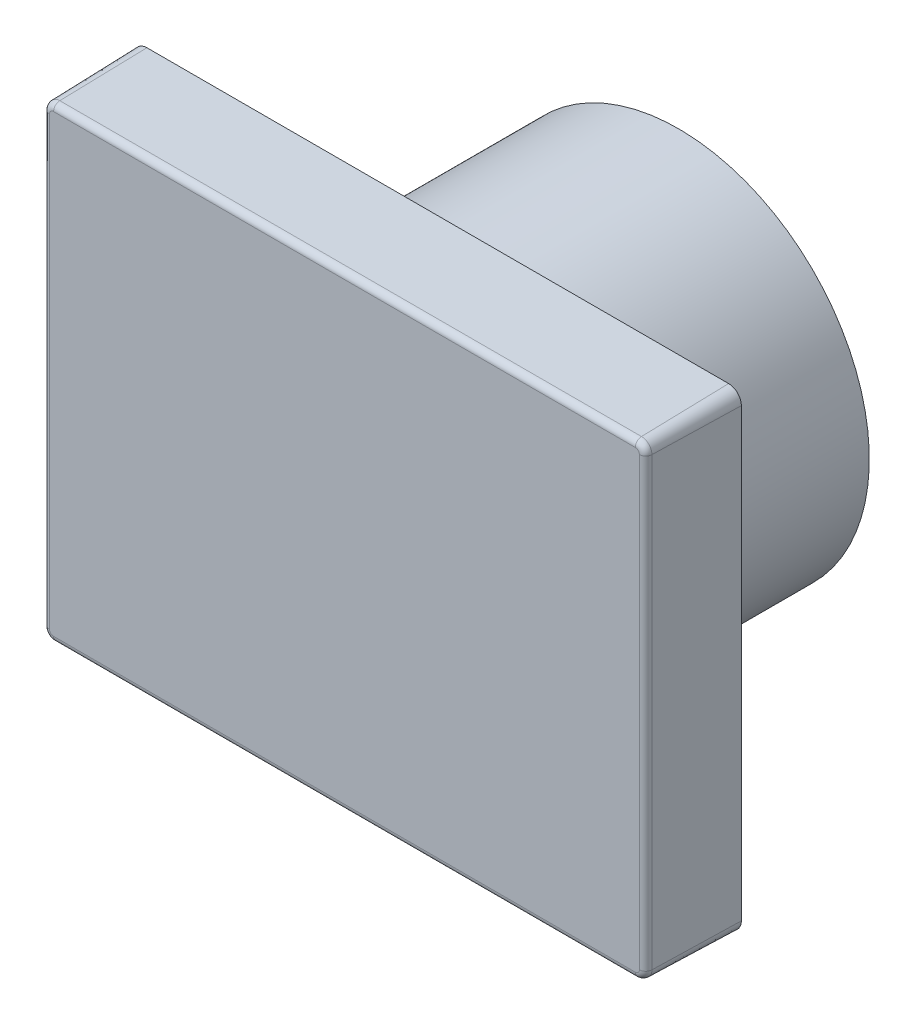
ISO-10303-21;
HEADER;
FILE_DESCRIPTION(('STEP AP214'),'2;1');
FILE_NAME('part.step','',(''),(''),'','','');
FILE_SCHEMA(('AUTOMOTIVE_DESIGN { 1 0 10303 214 1 1 1 1 }'));
ENDSEC;
DATA;
#1=APPLICATION_CONTEXT('core data for automotive mechanical design processes');
#2=APPLICATION_PROTOCOL_DEFINITION('international standard','automotive_design',2000,#1);
#3=PRODUCT_CONTEXT('',#1,'mechanical');
#4=PRODUCT('Part','Part','',(#3));
#5=PRODUCT_RELATED_PRODUCT_CATEGORY('part','',(#4));
#6=PRODUCT_DEFINITION_FORMATION('','',#4);
#7=PRODUCT_DEFINITION_CONTEXT('part definition',#1,'design');
#8=PRODUCT_DEFINITION('design','',#6,#7);
#9=PRODUCT_DEFINITION_SHAPE('','',#8);
#10=(LENGTH_UNIT() NAMED_UNIT(*) SI_UNIT(.MILLI.,.METRE.));
#11=(NAMED_UNIT(*) PLANE_ANGLE_UNIT() SI_UNIT($,.RADIAN.));
#12=(NAMED_UNIT(*) SI_UNIT($,.STERADIAN.) SOLID_ANGLE_UNIT());
#13=UNCERTAINTY_MEASURE_WITH_UNIT(LENGTH_MEASURE(1.E-05),#10,'distance_accuracy_value','');
#14=(GEOMETRIC_REPRESENTATION_CONTEXT(3) GLOBAL_UNCERTAINTY_ASSIGNED_CONTEXT((#13)) GLOBAL_UNIT_ASSIGNED_CONTEXT((#10,
#11,#12)) REPRESENTATION_CONTEXT('',''));
#15=CARTESIAN_POINT('',(0.,0.,0.));
#16=DIRECTION('',(0.,0.,1.));
#17=DIRECTION('',(1.,0.,0.));
#18=AXIS2_PLACEMENT_3D('',#15,#16,#17);
#19=CARTESIAN_POINT('',(0.,0.,-24.));
#20=DIRECTION('',(0.,0.,-1.));
#21=DIRECTION('',(-1.,0.,0.));
#22=AXIS2_PLACEMENT_3D('',#19,#20,#21);
#23=PLANE('',#22);
#24=CARTESIAN_POINT('',(0.,0.,-24.));
#25=DIRECTION('',(0.,0.,-1.));
#26=DIRECTION('',(-1.,0.,0.));
#27=AXIS2_PLACEMENT_3D('',#24,#25,#26);
#28=CIRCLE('',#27,19.);
#29=CARTESIAN_POINT('',(-19.,0.,-24.));
#30=VERTEX_POINT('',#29);
#31=EDGE_CURVE('E209',#30,#30,#28,.T.);
#32=ORIENTED_EDGE('',*,*,#31,.T.);
#33=EDGE_LOOP('',(#32));
#34=FACE_BOUND('',#33,.T.);
#35=CARTESIAN_POINT('',(0.,0.,-24.));
#36=DIRECTION('',(0.,0.,-1.));
#37=DIRECTION('',(-1.,0.,0.));
#38=AXIS2_PLACEMENT_3D('',#35,#36,#37);
#39=CIRCLE('',#38,2.);
#40=CARTESIAN_POINT('',(-2.,0.,-24.));
#41=VERTEX_POINT('',#40);
#42=EDGE_CURVE('E244',#41,#41,#39,.T.);
#43=ORIENTED_EDGE('',*,*,#42,.F.);
#44=EDGE_LOOP('',(#43));
#45=FACE_BOUND('',#44,.T.);
#46=ADVANCED_FACE('F36',(#34,#45),#23,.T.);
#47=CARTESIAN_POINT('',(0.,0.,0.));
#48=DIRECTION('',(0.,0.,-1.));
#49=DIRECTION('',(-1.,0.,0.));
#50=AXIS2_PLACEMENT_3D('',#47,#48,#49);
#51=PLANE('',#50);
#52=DIRECTION('',(1.,0.,0.));
#53=VECTOR('',#52,1.);
#54=CARTESIAN_POINT('',(-30.25,-23.5,0.));
#55=LINE('',#54,#53);
#56=CARTESIAN_POINT('',(-28.98,-23.5,0.));
#57=VERTEX_POINT('',#56);
#58=CARTESIAN_POINT('',(28.98,-23.5,0.));
#59=VERTEX_POINT('',#58);
#60=EDGE_CURVE('E132',#57,#59,#55,.T.);
#61=ORIENTED_EDGE('',*,*,#60,.F.);
#62=CARTESIAN_POINT('',(-28.98,-22.23,0.));
#63=DIRECTION('',(0.,0.,-1.));
#64=DIRECTION('',(-1.,0.,0.));
#65=AXIS2_PLACEMENT_3D('',#62,#63,#64);
#66=CIRCLE('',#65,1.27);
#67=CARTESIAN_POINT('',(-30.25,-22.23,0.));
#68=VERTEX_POINT('',#67);
#69=EDGE_CURVE('E142',#57,#68,#66,.T.);
#70=ORIENTED_EDGE('',*,*,#69,.T.);
#71=DIRECTION('',(0.,-1.,0.));
#72=VECTOR('',#71,1.);
#73=CARTESIAN_POINT('',(-30.25,-23.5,0.));
#74=LINE('',#73,#72);
#75=CARTESIAN_POINT('',(-30.25,22.23,0.));
#76=VERTEX_POINT('',#75);
#77=EDGE_CURVE('E156',#76,#68,#74,.T.);
#78=ORIENTED_EDGE('',*,*,#77,.F.);
#79=CARTESIAN_POINT('',(-28.98,22.23,0.));
#80=DIRECTION('',(0.,0.,-1.));
#81=DIRECTION('',(-1.,0.,0.));
#82=AXIS2_PLACEMENT_3D('',#79,#80,#81);
#83=CIRCLE('',#82,1.27);
#84=CARTESIAN_POINT('',(-28.98,23.5,0.));
#85=VERTEX_POINT('',#84);
#86=EDGE_CURVE('E138',#76,#85,#83,.T.);
#87=ORIENTED_EDGE('',*,*,#86,.T.);
#88=DIRECTION('',(-1.,0.,0.));
#89=VECTOR('',#88,1.);
#90=CARTESIAN_POINT('',(-30.25,23.5,0.));
#91=LINE('',#90,#89);
#92=CARTESIAN_POINT('',(28.98,23.5,0.));
#93=VERTEX_POINT('',#92);
#94=EDGE_CURVE('E159',#93,#85,#91,.T.);
#95=ORIENTED_EDGE('',*,*,#94,.F.);
#96=CARTESIAN_POINT('',(28.98,22.23,0.));
#97=DIRECTION('',(0.,0.,-1.));
#98=DIRECTION('',(-1.,0.,0.));
#99=AXIS2_PLACEMENT_3D('',#96,#97,#98);
#100=CIRCLE('',#99,1.27);
#101=CARTESIAN_POINT('',(30.25,22.23,0.));
#102=VERTEX_POINT('',#101);
#103=EDGE_CURVE('E164',#93,#102,#100,.T.);
#104=ORIENTED_EDGE('',*,*,#103,.T.);
#105=DIRECTION('',(0.,1.,0.));
#106=VECTOR('',#105,1.);
#107=CARTESIAN_POINT('',(30.25,-23.5,0.));
#108=LINE('',#107,#106);
#109=CARTESIAN_POINT('',(30.25,-22.23,0.));
#110=VERTEX_POINT('',#109);
#111=EDGE_CURVE('E228',#110,#102,#108,.T.);
#112=ORIENTED_EDGE('',*,*,#111,.F.);
#113=CARTESIAN_POINT('',(28.98,-22.23,0.));
#114=DIRECTION('',(0.,0.,-1.));
#115=DIRECTION('',(-1.,0.,0.));
#116=AXIS2_PLACEMENT_3D('',#113,#114,#115);
#117=CIRCLE('',#116,1.27);
#118=EDGE_CURVE('E150',#110,#59,#117,.T.);
#119=ORIENTED_EDGE('',*,*,#118,.T.);
#120=EDGE_LOOP('',(#61,#70,#78,#87,#95,#104,#112,#119));
#121=FACE_BOUND('',#120,.T.);
#122=CARTESIAN_POINT('',(0.,0.,0.));
#123=DIRECTION('',(0.,0.,-1.));
#124=DIRECTION('',(-1.,0.,0.));
#125=AXIS2_PLACEMENT_3D('',#122,#123,#124);
#126=CIRCLE('',#125,19.);
#127=CARTESIAN_POINT('',(-19.,0.,0.));
#128=VERTEX_POINT('',#127);
#129=EDGE_CURVE('E238',#128,#128,#126,.T.);
#130=ORIENTED_EDGE('',*,*,#129,.F.);
#131=EDGE_LOOP('',(#130));
#132=FACE_BOUND('',#131,.T.);
#133=ADVANCED_FACE('F152',(#121,#132),#51,.T.);
#134=CARTESIAN_POINT('',(30.25,-23.5,0.));
#135=DIRECTION('',(0.999657324975557,0.,0.0261769483078732));
#136=DIRECTION('',(0.0261769483078732,0.,-0.999657324975557));
#137=AXIS2_PLACEMENT_3D('',#134,#135,#136);
#138=PLANE('',#137);
#139=DIRECTION('',(0.0261769483078732,0.,-0.999657324975557));
#140=VECTOR('',#139,1.);
#141=CARTESIAN_POINT('',(30.25,22.23,0.));
#142=LINE('',#141,#140);
#143=CARTESIAN_POINT('',(30.0226637177308,22.23,8.6816223621755));
#144=VERTEX_POINT('',#143);
#145=EDGE_CURVE('E170',#102,#144,#142,.F.);
#146=ORIENTED_EDGE('',*,*,#145,.T.);
#147=DIRECTION('',(0.,1.,0.));
#148=VECTOR('',#147,1.);
#149=CARTESIAN_POINT('',(30.0226637177308,-23.5,8.6816223621755));
#150=LINE('',#149,#148);
#151=CARTESIAN_POINT('',(30.0226637177308,-22.23,8.6816223621755));
#152=VERTEX_POINT('',#151);
#153=EDGE_CURVE('E11',#144,#152,#150,.F.);
#154=ORIENTED_EDGE('',*,*,#153,.T.);
#155=DIRECTION('',(0.0261769483078732,0.,-0.999657324975557));
#156=VECTOR('',#155,1.);
#157=CARTESIAN_POINT('',(30.25,-22.23,0.));
#158=LINE('',#157,#156);
#159=EDGE_CURVE('E167',#152,#110,#158,.T.);
#160=ORIENTED_EDGE('',*,*,#159,.T.);
#161=ORIENTED_EDGE('',*,*,#111,.T.);
#162=EDGE_LOOP('',(#146,#154,#160,#161));
#163=FACE_BOUND('',#162,.T.);
#164=ADVANCED_FACE('F265',(#163),#138,.T.);
#165=CARTESIAN_POINT('',(-30.25,23.5,0.));
#166=DIRECTION('',(0.,0.999657324975557,0.0261769483078732));
#167=DIRECTION('',(0.,-0.0261769483078732,0.999657324975557));
#168=AXIS2_PLACEMENT_3D('',#165,#166,#167);
#169=PLANE('',#168);
#170=DIRECTION('',(0.,0.0261769483078732,-0.999657324975557));
#171=VECTOR('',#170,1.);
#172=CARTESIAN_POINT('',(-28.98,23.5,0.));
#173=LINE('',#172,#171);
#174=CARTESIAN_POINT('',(-28.98,23.2726637177308,8.6816223621755));
#175=VERTEX_POINT('',#174);
#176=EDGE_CURVE('E169',#85,#175,#173,.F.);
#177=ORIENTED_EDGE('',*,*,#176,.T.);
#178=DIRECTION('',(-1.,0.,0.));
#179=VECTOR('',#178,1.);
#180=CARTESIAN_POINT('',(-30.25,23.2726637177308,8.6816223621755));
#181=LINE('',#180,#179);
#182=CARTESIAN_POINT('',(28.98,23.2726637177308,8.6816223621755));
#183=VERTEX_POINT('',#182);
#184=EDGE_CURVE('E60',#175,#183,#181,.F.);
#185=ORIENTED_EDGE('',*,*,#184,.T.);
#186=DIRECTION('',(0.,0.0261769483078732,-0.999657324975557));
#187=VECTOR('',#186,1.);
#188=CARTESIAN_POINT('',(28.98,23.5,0.));
#189=LINE('',#188,#187);
#190=EDGE_CURVE('E171',#183,#93,#189,.T.);
#191=ORIENTED_EDGE('',*,*,#190,.T.);
#192=ORIENTED_EDGE('',*,*,#94,.T.);
#193=EDGE_LOOP('',(#177,#185,#191,#192));
#194=FACE_BOUND('',#193,.T.);
#195=ADVANCED_FACE('F289',(#194),#169,.T.);
#196=CARTESIAN_POINT('',(-30.25,-23.5,0.));
#197=DIRECTION('',(-0.999657324975557,0.,0.0261769483078732));
#198=DIRECTION('',(0.0261769483078732,0.,0.999657324975557));
#199=AXIS2_PLACEMENT_3D('',#196,#197,#198);
#200=PLANE('',#199);
#201=DIRECTION('',(-0.0261769483078732,0.,-0.999657324975557));
#202=VECTOR('',#201,1.);
#203=CARTESIAN_POINT('',(-30.25,-22.23,0.));
#204=LINE('',#203,#202);
#205=CARTESIAN_POINT('',(-30.0226637177308,-22.23,8.6816223621755));
#206=VERTEX_POINT('',#205);
#207=EDGE_CURVE('E145',#68,#206,#204,.F.);
#208=ORIENTED_EDGE('',*,*,#207,.T.);
#209=DIRECTION('',(0.,-1.,0.));
#210=VECTOR('',#209,1.);
#211=CARTESIAN_POINT('',(-30.0226637177308,-23.5,8.6816223621755));
#212=LINE('',#211,#210);
#213=CARTESIAN_POINT('',(-30.0226637177308,22.23,8.6816223621755));
#214=VERTEX_POINT('',#213);
#215=EDGE_CURVE('E200',#206,#214,#212,.F.);
#216=ORIENTED_EDGE('',*,*,#215,.T.);
#217=DIRECTION('',(-0.0261769483078732,0.,-0.999657324975557));
#218=VECTOR('',#217,1.);
#219=CARTESIAN_POINT('',(-30.25,22.23,0.));
#220=LINE('',#219,#218);
#221=EDGE_CURVE('E149',#214,#76,#220,.T.);
#222=ORIENTED_EDGE('',*,*,#221,.T.);
#223=ORIENTED_EDGE('',*,*,#77,.T.);
#224=EDGE_LOOP('',(#208,#216,#222,#223));
#225=FACE_BOUND('',#224,.T.);
#226=ADVANCED_FACE('F282',(#225),#200,.T.);
#227=CARTESIAN_POINT('',(-30.25,-23.5,0.));
#228=DIRECTION('',(0.,-0.999657324975557,0.0261769483078732));
#229=DIRECTION('',(0.,-0.0261769483078732,-0.999657324975557));
#230=AXIS2_PLACEMENT_3D('',#227,#228,#229);
#231=PLANE('',#230);
#232=DIRECTION('',(0.,-0.0261769483078732,-0.999657324975557));
#233=VECTOR('',#232,1.);
#234=CARTESIAN_POINT('',(28.98,-23.5,0.));
#235=LINE('',#234,#233);
#236=CARTESIAN_POINT('',(28.98,-23.2726637177308,8.6816223621755));
#237=VERTEX_POINT('',#236);
#238=EDGE_CURVE('E139',#59,#237,#235,.F.);
#239=ORIENTED_EDGE('',*,*,#238,.T.);
#240=DIRECTION('',(1.,0.,0.));
#241=VECTOR('',#240,1.);
#242=CARTESIAN_POINT('',(-30.25,-23.2726637177308,8.6816223621755));
#243=LINE('',#242,#241);
#244=CARTESIAN_POINT('',(-28.98,-23.2726637177308,8.6816223621755));
#245=VERTEX_POINT('',#244);
#246=EDGE_CURVE('E135',#237,#245,#243,.F.);
#247=ORIENTED_EDGE('',*,*,#246,.T.);
#248=DIRECTION('',(0.,-0.0261769483078732,-0.999657324975557));
#249=VECTOR('',#248,1.);
#250=CARTESIAN_POINT('',(-28.98,-23.5,0.));
#251=LINE('',#250,#249);
#252=EDGE_CURVE('E127',#245,#57,#251,.T.);
#253=ORIENTED_EDGE('',*,*,#252,.T.);
#254=ORIENTED_EDGE('',*,*,#60,.T.);
#255=EDGE_LOOP('',(#239,#247,#253,#254));
#256=FACE_BOUND('',#255,.T.);
#257=ADVANCED_FACE('F130',(#256),#231,.T.);
#258=CARTESIAN_POINT('',(0.,0.,9.3));
#259=DIRECTION('',(0.,0.,-1.));
#260=DIRECTION('',(-1.,0.,0.));
#261=AXIS2_PLACEMENT_3D('',#258,#259,#260);
#262=PLANE('',#261);
#263=DIRECTION('',(-1.,0.,0.));
#264=VECTOR('',#263,1.);
#265=CARTESIAN_POINT('',(0.,-22.6378813163713,9.3));
#266=LINE('',#265,#264);
#267=CARTESIAN_POINT('',(-28.98,-22.6378813163713,9.3));
#268=VERTEX_POINT('',#267);
#269=CARTESIAN_POINT('',(28.98,-22.6378813163713,9.3));
#270=VERTEX_POINT('',#269);
#271=EDGE_CURVE('E189',#268,#270,#266,.F.);
#272=ORIENTED_EDGE('',*,*,#271,.T.);
#273=CARTESIAN_POINT('',(28.98,-22.23,9.3));
#274=DIRECTION('',(0.,0.,-1.));
#275=DIRECTION('',(-1.,0.,0.));
#276=AXIS2_PLACEMENT_3D('',#273,#274,#275);
#277=CIRCLE('',#276,0.407881316371294);
#278=CARTESIAN_POINT('',(29.3878813163713,-22.23,9.3));
#279=VERTEX_POINT('',#278);
#280=EDGE_CURVE('E191',#270,#279,#277,.F.);
#281=ORIENTED_EDGE('',*,*,#280,.T.);
#282=DIRECTION('',(0.,-1.,0.));
#283=VECTOR('',#282,1.);
#284=CARTESIAN_POINT('',(29.3878813163713,0.,9.3));
#285=LINE('',#284,#283);
#286=CARTESIAN_POINT('',(29.3878813163713,22.23,9.3));
#287=VERTEX_POINT('',#286);
#288=EDGE_CURVE('E173',#279,#287,#285,.F.);
#289=ORIENTED_EDGE('',*,*,#288,.T.);
#290=CARTESIAN_POINT('',(28.98,22.23,9.3));
#291=DIRECTION('',(0.,0.,-1.));
#292=DIRECTION('',(-1.,0.,0.));
#293=AXIS2_PLACEMENT_3D('',#290,#291,#292);
#294=CIRCLE('',#293,0.407881316371294);
#295=CARTESIAN_POINT('',(28.98,22.6378813163713,9.3));
#296=VERTEX_POINT('',#295);
#297=EDGE_CURVE('E179',#287,#296,#294,.F.);
#298=ORIENTED_EDGE('',*,*,#297,.T.);
#299=DIRECTION('',(1.,0.,0.));
#300=VECTOR('',#299,1.);
#301=CARTESIAN_POINT('',(0.,22.6378813163713,9.3));
#302=LINE('',#301,#300);
#303=CARTESIAN_POINT('',(-28.98,22.6378813163713,9.3));
#304=VERTEX_POINT('',#303);
#305=EDGE_CURVE('E181',#296,#304,#302,.F.);
#306=ORIENTED_EDGE('',*,*,#305,.T.);
#307=CARTESIAN_POINT('',(-28.98,22.23,9.3));
#308=DIRECTION('',(0.,0.,-1.));
#309=DIRECTION('',(-1.,0.,0.));
#310=AXIS2_PLACEMENT_3D('',#307,#308,#309);
#311=CIRCLE('',#310,0.407881316371294);
#312=CARTESIAN_POINT('',(-29.3878813163713,22.23,9.3));
#313=VERTEX_POINT('',#312);
#314=EDGE_CURVE('E183',#304,#313,#311,.F.);
#315=ORIENTED_EDGE('',*,*,#314,.T.);
#316=DIRECTION('',(0.,1.,0.));
#317=VECTOR('',#316,1.);
#318=CARTESIAN_POINT('',(-29.3878813163713,0.,9.3));
#319=LINE('',#318,#317);
#320=CARTESIAN_POINT('',(-29.3878813163713,-22.23,9.3));
#321=VERTEX_POINT('',#320);
#322=EDGE_CURVE('E185',#313,#321,#319,.F.);
#323=ORIENTED_EDGE('',*,*,#322,.T.);
#324=CARTESIAN_POINT('',(-28.98,-22.23,9.3));
#325=DIRECTION('',(0.,0.,-1.));
#326=DIRECTION('',(-1.,0.,0.));
#327=AXIS2_PLACEMENT_3D('',#324,#325,#326);
#328=CIRCLE('',#327,0.407881316371294);
#329=EDGE_CURVE('E187',#321,#268,#328,.F.);
#330=ORIENTED_EDGE('',*,*,#329,.T.);
#331=EDGE_LOOP('',(#272,#281,#289,#298,#306,#315,#323,#330));
#332=FACE_BOUND('',#331,.T.);
#333=ADVANCED_FACE('F273',(#332),#262,.F.);
#334=CARTESIAN_POINT('',(-28.98,-22.23,0.));
#335=DIRECTION('',(0.,0.,-1.));
#336=DIRECTION('',(-1.,0.,0.));
#337=AXIS2_PLACEMENT_3D('',#334,#335,#336);
#338=CONICAL_SURFACE('',#337,1.27,0.026179938779915);
#339=ORIENTED_EDGE('',*,*,#252,.F.);
#340=CARTESIAN_POINT('',(-28.98,-22.23,8.6816223621755));
#341=DIRECTION('',(0.,0.,-1.));
#342=DIRECTION('',(-1.,0.,0.));
#343=AXIS2_PLACEMENT_3D('',#340,#341,#342);
#344=CIRCLE('',#343,1.04266371773077);
#345=EDGE_CURVE('E198',#245,#206,#344,.T.);
#346=ORIENTED_EDGE('',*,*,#345,.T.);
#347=ORIENTED_EDGE('',*,*,#207,.F.);
#348=ORIENTED_EDGE('',*,*,#69,.F.);
#349=EDGE_LOOP('',(#339,#346,#347,#348));
#350=FACE_BOUND('',#349,.T.);
#351=ADVANCED_FACE('F143',(#350),#338,.T.);
#352=CARTESIAN_POINT('',(28.98,-22.23,0.));
#353=DIRECTION('',(0.,0.,-1.));
#354=DIRECTION('',(-1.,0.,0.));
#355=AXIS2_PLACEMENT_3D('',#352,#353,#354);
#356=CONICAL_SURFACE('',#355,1.27,0.026179938779915);
#357=ORIENTED_EDGE('',*,*,#159,.F.);
#358=CARTESIAN_POINT('',(28.98,-22.23,8.6816223621755));
#359=DIRECTION('',(0.,0.,-1.));
#360=DIRECTION('',(-1.,0.,0.));
#361=AXIS2_PLACEMENT_3D('',#358,#359,#360);
#362=CIRCLE('',#361,1.04266371773077);
#363=EDGE_CURVE('E194',#152,#237,#362,.T.);
#364=ORIENTED_EDGE('',*,*,#363,.T.);
#365=ORIENTED_EDGE('',*,*,#238,.F.);
#366=ORIENTED_EDGE('',*,*,#118,.F.);
#367=EDGE_LOOP('',(#357,#364,#365,#366));
#368=FACE_BOUND('',#367,.T.);
#369=ADVANCED_FACE('F279',(#368),#356,.T.);
#370=CARTESIAN_POINT('',(28.98,22.23,0.));
#371=DIRECTION('',(0.,0.,-1.));
#372=DIRECTION('',(-1.,0.,0.));
#373=AXIS2_PLACEMENT_3D('',#370,#371,#372);
#374=CONICAL_SURFACE('',#373,1.27,0.026179938779915);
#375=ORIENTED_EDGE('',*,*,#190,.F.);
#376=CARTESIAN_POINT('',(28.98,22.23,8.6816223621755));
#377=DIRECTION('',(0.,0.,-1.));
#378=DIRECTION('',(-1.,0.,0.));
#379=AXIS2_PLACEMENT_3D('',#376,#377,#378);
#380=CIRCLE('',#379,1.04266371773077);
#381=EDGE_CURVE('E45',#183,#144,#380,.T.);
#382=ORIENTED_EDGE('',*,*,#381,.T.);
#383=ORIENTED_EDGE('',*,*,#145,.F.);
#384=ORIENTED_EDGE('',*,*,#103,.F.);
#385=EDGE_LOOP('',(#375,#382,#383,#384));
#386=FACE_BOUND('',#385,.T.);
#387=ADVANCED_FACE('F285',(#386),#374,.T.);
#388=CARTESIAN_POINT('',(-28.98,22.23,0.));
#389=DIRECTION('',(0.,0.,-1.));
#390=DIRECTION('',(-1.,0.,0.));
#391=AXIS2_PLACEMENT_3D('',#388,#389,#390);
#392=CONICAL_SURFACE('',#391,1.27,0.026179938779915);
#393=ORIENTED_EDGE('',*,*,#221,.F.);
#394=CARTESIAN_POINT('',(-28.98,22.23,8.6816223621755));
#395=DIRECTION('',(0.,0.,-1.));
#396=DIRECTION('',(-1.,0.,0.));
#397=AXIS2_PLACEMENT_3D('',#394,#395,#396);
#398=CIRCLE('',#397,1.04266371773077);
#399=EDGE_CURVE('E202',#214,#175,#398,.T.);
#400=ORIENTED_EDGE('',*,*,#399,.T.);
#401=ORIENTED_EDGE('',*,*,#176,.F.);
#402=ORIENTED_EDGE('',*,*,#86,.F.);
#403=EDGE_LOOP('',(#393,#400,#401,#402));
#404=FACE_BOUND('',#403,.T.);
#405=ADVANCED_FACE('F292',(#404),#392,.T.);
#406=CARTESIAN_POINT('',(-28.98,22.23,8.665));
#407=DIRECTION('',(0.,0.,-1.));
#408=DIRECTION('',(-1.,0.,0.));
#409=AXIS2_PLACEMENT_3D('',#406,#407,#408);
#410=DEGENERATE_TOROIDAL_SURFACE('',#409,0.407881316371294,0.635,.T.);
#411=CARTESIAN_POINT('',(-28.98,22.6378813163713,8.665));
#412=DIRECTION('',(1.,0.,0.));
#413=DIRECTION('',(0.,0.,-1.));
#414=AXIS2_PLACEMENT_3D('',#411,#412,#413);
#415=CIRCLE('',#414,0.635);
#416=EDGE_CURVE('E222',#175,#304,#415,.T.);
#417=ORIENTED_EDGE('',*,*,#416,.F.);
#418=ORIENTED_EDGE('',*,*,#399,.F.);
#419=CARTESIAN_POINT('',(-29.3878813163713,22.23,8.665));
#420=DIRECTION('',(0.,-1.,0.));
#421=DIRECTION('',(0.,0.,-1.));
#422=AXIS2_PLACEMENT_3D('',#419,#420,#421);
#423=CIRCLE('',#422,0.635);
#424=EDGE_CURVE('E40',#313,#214,#423,.T.);
#425=ORIENTED_EDGE('',*,*,#424,.F.);
#426=ORIENTED_EDGE('',*,*,#314,.F.);
#427=EDGE_LOOP('',(#417,#418,#425,#426));
#428=FACE_BOUND('',#427,.T.);
#429=ADVANCED_FACE('F38',(#428),#410,.T.);
#430=CARTESIAN_POINT('',(-29.3878813163713,0.,8.665));
#431=DIRECTION('',(0.,1.,0.));
#432=DIRECTION('',(0.,0.,1.));
#433=AXIS2_PLACEMENT_3D('',#430,#431,#432);
#434=CYLINDRICAL_SURFACE('',#433,0.635);
#435=ORIENTED_EDGE('',*,*,#424,.T.);
#436=ORIENTED_EDGE('',*,*,#215,.F.);
#437=CARTESIAN_POINT('',(-29.3878813163713,-22.23,8.665));
#438=DIRECTION('',(0.,-1.,0.));
#439=DIRECTION('',(0.,0.,-1.));
#440=AXIS2_PLACEMENT_3D('',#437,#438,#439);
#441=CIRCLE('',#440,0.635);
#442=EDGE_CURVE('E220',#321,#206,#441,.T.);
#443=ORIENTED_EDGE('',*,*,#442,.F.);
#444=ORIENTED_EDGE('',*,*,#322,.F.);
#445=EDGE_LOOP('',(#435,#436,#443,#444));
#446=FACE_BOUND('',#445,.T.);
#447=ADVANCED_FACE('F322',(#446),#434,.T.);
#448=CARTESIAN_POINT('',(0.,22.6378813163713,8.665));
#449=DIRECTION('',(1.,0.,0.));
#450=DIRECTION('',(0.,0.,-1.));
#451=AXIS2_PLACEMENT_3D('',#448,#449,#450);
#452=CYLINDRICAL_SURFACE('',#451,0.635);
#453=ORIENTED_EDGE('',*,*,#416,.T.);
#454=ORIENTED_EDGE('',*,*,#305,.F.);
#455=CARTESIAN_POINT('',(28.98,22.6378813163713,8.665));
#456=DIRECTION('',(1.,0.,0.));
#457=DIRECTION('',(0.,0.,-1.));
#458=AXIS2_PLACEMENT_3D('',#455,#456,#457);
#459=CIRCLE('',#458,0.635);
#460=EDGE_CURVE('E217',#183,#296,#459,.T.);
#461=ORIENTED_EDGE('',*,*,#460,.F.);
#462=ORIENTED_EDGE('',*,*,#184,.F.);
#463=EDGE_LOOP('',(#453,#454,#461,#462));
#464=FACE_BOUND('',#463,.T.);
#465=ADVANCED_FACE('F319',(#464),#452,.T.);
#466=CARTESIAN_POINT('',(-28.98,-22.23,8.665));
#467=DIRECTION('',(0.,0.,-1.));
#468=DIRECTION('',(-1.,0.,0.));
#469=AXIS2_PLACEMENT_3D('',#466,#467,#468);
#470=DEGENERATE_TOROIDAL_SURFACE('',#469,0.407881316371294,0.635,.T.);
#471=ORIENTED_EDGE('',*,*,#442,.T.);
#472=ORIENTED_EDGE('',*,*,#345,.F.);
#473=CARTESIAN_POINT('',(-28.98,-22.6378813163713,8.665));
#474=DIRECTION('',(1.,0.,0.));
#475=DIRECTION('',(0.,0.,-1.));
#476=AXIS2_PLACEMENT_3D('',#473,#474,#475);
#477=CIRCLE('',#476,0.635);
#478=EDGE_CURVE('E214',#268,#245,#477,.T.);
#479=ORIENTED_EDGE('',*,*,#478,.F.);
#480=ORIENTED_EDGE('',*,*,#329,.F.);
#481=EDGE_LOOP('',(#471,#472,#479,#480));
#482=FACE_BOUND('',#481,.T.);
#483=ADVANCED_FACE('F315',(#482),#470,.T.);
#484=CARTESIAN_POINT('',(28.98,22.23,8.665));
#485=DIRECTION('',(0.,0.,-1.));
#486=DIRECTION('',(-1.,0.,0.));
#487=AXIS2_PLACEMENT_3D('',#484,#485,#486);
#488=DEGENERATE_TOROIDAL_SURFACE('',#487,0.407881316371294,0.635,.T.);
#489=ORIENTED_EDGE('',*,*,#460,.T.);
#490=ORIENTED_EDGE('',*,*,#297,.F.);
#491=CARTESIAN_POINT('',(29.3878813163713,22.23,8.665));
#492=DIRECTION('',(0.,-1.,0.));
#493=DIRECTION('',(1.,0.,0.));
#494=AXIS2_PLACEMENT_3D('',#491,#492,#493);
#495=CIRCLE('',#494,0.635);
#496=EDGE_CURVE('E211',#144,#287,#495,.T.);
#497=ORIENTED_EDGE('',*,*,#496,.F.);
#498=ORIENTED_EDGE('',*,*,#381,.F.);
#499=EDGE_LOOP('',(#489,#490,#497,#498));
#500=FACE_BOUND('',#499,.T.);
#501=ADVANCED_FACE('F311',(#500),#488,.T.);
#502=CARTESIAN_POINT('',(0.,-22.6378813163713,8.665));
#503=DIRECTION('',(-1.,0.,0.));
#504=DIRECTION('',(0.,0.,1.));
#505=AXIS2_PLACEMENT_3D('',#502,#503,#504);
#506=CYLINDRICAL_SURFACE('',#505,0.635);
#507=ORIENTED_EDGE('',*,*,#478,.T.);
#508=ORIENTED_EDGE('',*,*,#246,.F.);
#509=CARTESIAN_POINT('',(28.98,-22.6378813163713,8.665));
#510=DIRECTION('',(1.,0.,0.));
#511=DIRECTION('',(0.,1.,0.));
#512=AXIS2_PLACEMENT_3D('',#509,#510,#511);
#513=CIRCLE('',#512,0.635);
#514=EDGE_CURVE('E208',#270,#237,#513,.T.);
#515=ORIENTED_EDGE('',*,*,#514,.F.);
#516=ORIENTED_EDGE('',*,*,#271,.F.);
#517=EDGE_LOOP('',(#507,#508,#515,#516));
#518=FACE_BOUND('',#517,.T.);
#519=ADVANCED_FACE('F307',(#518),#506,.T.);
#520=CARTESIAN_POINT('',(29.3878813163713,0.,8.665));
#521=DIRECTION('',(0.,-1.,0.));
#522=DIRECTION('',(0.,0.,-1.));
#523=AXIS2_PLACEMENT_3D('',#520,#521,#522);
#524=CYLINDRICAL_SURFACE('',#523,0.635);
#525=ORIENTED_EDGE('',*,*,#496,.T.);
#526=ORIENTED_EDGE('',*,*,#288,.F.);
#527=CARTESIAN_POINT('',(29.3878813163713,-22.23,8.665));
#528=DIRECTION('',(0.,-1.,0.));
#529=DIRECTION('',(0.,0.,-1.));
#530=AXIS2_PLACEMENT_3D('',#527,#528,#529);
#531=CIRCLE('',#530,0.635);
#532=EDGE_CURVE('E206',#152,#279,#531,.T.);
#533=ORIENTED_EDGE('',*,*,#532,.F.);
#534=ORIENTED_EDGE('',*,*,#153,.F.);
#535=EDGE_LOOP('',(#525,#526,#533,#534));
#536=FACE_BOUND('',#535,.T.);
#537=ADVANCED_FACE('F303',(#536),#524,.T.);
#538=CARTESIAN_POINT('',(28.98,-22.23,8.665));
#539=DIRECTION('',(0.,0.,-1.));
#540=DIRECTION('',(-1.,0.,0.));
#541=AXIS2_PLACEMENT_3D('',#538,#539,#540);
#542=DEGENERATE_TOROIDAL_SURFACE('',#541,0.407881316371294,0.635,.T.);
#543=ORIENTED_EDGE('',*,*,#514,.T.);
#544=ORIENTED_EDGE('',*,*,#363,.F.);
#545=ORIENTED_EDGE('',*,*,#532,.T.);
#546=ORIENTED_EDGE('',*,*,#280,.F.);
#547=EDGE_LOOP('',(#543,#544,#545,#546));
#548=FACE_BOUND('',#547,.T.);
#549=ADVANCED_FACE('F271',(#548),#542,.T.);
#550=CARTESIAN_POINT('',(0.,0.,-24.));
#551=DIRECTION('',(0.,0.,1.));
#552=DIRECTION('',(1.,0.,0.));
#553=AXIS2_PLACEMENT_3D('',#550,#551,#552);
#554=CYLINDRICAL_SURFACE('',#553,19.);
#555=ORIENTED_EDGE('',*,*,#31,.F.);
#556=EDGE_LOOP('',(#555));
#557=FACE_BOUND('',#556,.T.);
#558=ORIENTED_EDGE('',*,*,#129,.T.);
#559=EDGE_LOOP('',(#558));
#560=FACE_BOUND('',#559,.T.);
#561=ADVANCED_FACE('F255',(#557,#560),#554,.T.);
#562=CARTESIAN_POINT('',(0.,0.,-28.));
#563=DIRECTION('',(0.,0.,1.));
#564=DIRECTION('',(1.,0.,0.));
#565=AXIS2_PLACEMENT_3D('',#562,#563,#564);
#566=CYLINDRICAL_SURFACE('',#565,2.);
#567=CARTESIAN_POINT('',(0.,0.,-28.));
#568=DIRECTION('',(0.,0.,-1.));
#569=DIRECTION('',(-1.,0.,0.));
#570=AXIS2_PLACEMENT_3D('',#567,#568,#569);
#571=CIRCLE('',#570,2.);
#572=CARTESIAN_POINT('',(-2.,0.,-28.));
#573=VERTEX_POINT('',#572);
#574=EDGE_CURVE('E241',#573,#573,#571,.T.);
#575=ORIENTED_EDGE('',*,*,#574,.F.);
#576=EDGE_LOOP('',(#575));
#577=FACE_BOUND('',#576,.T.);
#578=ORIENTED_EDGE('',*,*,#42,.T.);
#579=EDGE_LOOP('',(#578));
#580=FACE_BOUND('',#579,.T.);
#581=ADVANCED_FACE('F252',(#577,#580),#566,.T.);
#582=CARTESIAN_POINT('',(0.,0.,-28.));
#583=DIRECTION('',(0.,0.,-1.));
#584=DIRECTION('',(-1.,0.,0.));
#585=AXIS2_PLACEMENT_3D('',#582,#583,#584);
#586=PLANE('',#585);
#587=ORIENTED_EDGE('',*,*,#574,.T.);
#588=EDGE_LOOP('',(#587));
#589=FACE_BOUND('',#588,.T.);
#590=ADVANCED_FACE('F250',(#589),#586,.T.);
#591=CLOSED_SHELL('',(#46,#133,#164,#195,#226,#257,#333,#351,#369,#387,#405,#429,#447,#465,#483,
#501,#519,#537,#549,#561,#581,#590));
#592=MANIFOLD_SOLID_BREP('B2',#591);
#593=ADVANCED_BREP_SHAPE_REPRESENTATION('',(#18,#592),#14);
#594=SHAPE_DEFINITION_REPRESENTATION(#9,#593);
ENDSEC;
END-ISO-10303-21;
